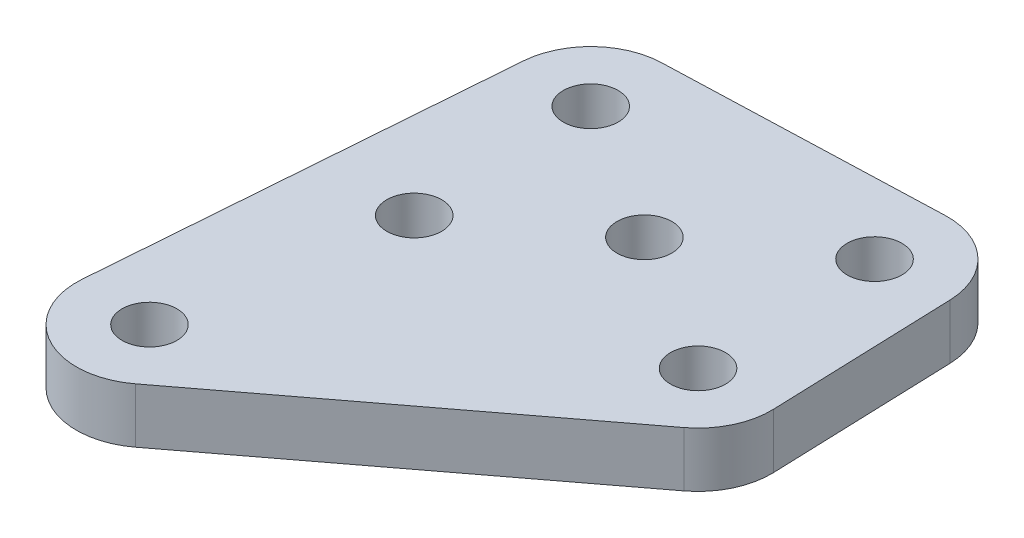
ISO-10303-21;
HEADER;
FILE_DESCRIPTION(('STEP AP214'),'2;1');
FILE_NAME('part.step','',(''),(''),'','','');
FILE_SCHEMA(('AUTOMOTIVE_DESIGN { 1 0 10303 214 1 1 1 1 }'));
ENDSEC;
DATA;
#1=APPLICATION_CONTEXT('core data for automotive mechanical design processes');
#2=APPLICATION_PROTOCOL_DEFINITION('international standard','automotive_design',2000,#1);
#3=PRODUCT_CONTEXT('',#1,'mechanical');
#4=PRODUCT('Part','Part','',(#3));
#5=PRODUCT_RELATED_PRODUCT_CATEGORY('part','',(#4));
#6=PRODUCT_DEFINITION_FORMATION('','',#4);
#7=PRODUCT_DEFINITION_CONTEXT('part definition',#1,'design');
#8=PRODUCT_DEFINITION('design','',#6,#7);
#9=PRODUCT_DEFINITION_SHAPE('','',#8);
#10=(LENGTH_UNIT() NAMED_UNIT(*) SI_UNIT(.MILLI.,.METRE.));
#11=(NAMED_UNIT(*) PLANE_ANGLE_UNIT() SI_UNIT($,.RADIAN.));
#12=(NAMED_UNIT(*) SI_UNIT($,.STERADIAN.) SOLID_ANGLE_UNIT());
#13=UNCERTAINTY_MEASURE_WITH_UNIT(LENGTH_MEASURE(1.E-05),#10,'distance_accuracy_value','');
#14=(GEOMETRIC_REPRESENTATION_CONTEXT(3) GLOBAL_UNCERTAINTY_ASSIGNED_CONTEXT((#13)) GLOBAL_UNIT_ASSIGNED_CONTEXT((#10,
#11,#12)) REPRESENTATION_CONTEXT('',''));
#15=CARTESIAN_POINT('',(0.,0.,0.));
#16=DIRECTION('',(0.,0.,1.));
#17=DIRECTION('',(1.,0.,0.));
#18=AXIS2_PLACEMENT_3D('',#15,#16,#17);
#19=CARTESIAN_POINT('',(-40.696719040631,3.,14.5724052640163));
#20=DIRECTION('',(0.,-1.,0.));
#21=DIRECTION('',(0.,0.,-1.));
#22=AXIS2_PLACEMENT_3D('',#19,#20,#21);
#23=PLANE('',#22);
#24=CARTESIAN_POINT('',(-40.696719040631,3.,14.5724052640163));
#25=DIRECTION('',(0.,1.,0.));
#26=DIRECTION('',(0.,0.,-1.));
#27=AXIS2_PLACEMENT_3D('',#24,#25,#26);
#28=CIRCLE('',#27,4.);
#29=CARTESIAN_POINT('',(-44.6849301355073,3.,14.2655302687726));
#30=VERTEX_POINT('',#29);
#31=CARTESIAN_POINT('',(-38.2818034081284,3.,17.7611640331763));
#32=VERTEX_POINT('',#31);
#33=EDGE_CURVE('E170',#30,#32,#28,.T.);
#34=ORIENTED_EDGE('',*,*,#33,.T.);
#35=DIRECTION('',(0.797189692289983,0.,-0.60372890812566));
#36=VECTOR('',#35,1.);
#37=CARTESIAN_POINT('',(-21.2203623667831,3.,4.84016759962625));
#38=LINE('',#37,#36);
#39=CARTESIAN_POINT('',(-21.2203623667831,3.,4.84016759962625));
#40=VERTEX_POINT('',#39);
#41=EDGE_CURVE('E106',#32,#40,#38,.T.);
#42=ORIENTED_EDGE('',*,*,#41,.T.);
#43=CARTESIAN_POINT('',(-23.6352779992858,3.,1.65140883046631));
#44=DIRECTION('',(0.,1.,0.));
#45=DIRECTION('',(0.,0.,-1.));
#46=AXIS2_PLACEMENT_3D('',#43,#44,#45);
#47=CIRCLE('',#46,4.00000000000001);
#48=CARTESIAN_POINT('',(-19.6376922613152,3.,1.51245463810774));
#49=VERTEX_POINT('',#48);
#50=EDGE_CURVE('E191',#40,#49,#47,.T.);
#51=ORIENTED_EDGE('',*,*,#50,.T.);
#52=DIRECTION('',(-0.0347385480896433,0.,-0.999396434492651));
#53=VECTOR('',#52,1.);
#54=CARTESIAN_POINT('',(-19.9850777422116,3.,-8.48150970681877));
#55=LINE('',#54,#53);
#56=CARTESIAN_POINT('',(-19.9850777422116,3.,-8.48150970681877));
#57=VERTEX_POINT('',#56);
#58=EDGE_CURVE('E205',#49,#57,#55,.T.);
#59=ORIENTED_EDGE('',*,*,#58,.T.);
#60=CARTESIAN_POINT('',(-23.9826634801822,3.,-8.34255551446019));
#61=DIRECTION('',(0.,1.,0.));
#62=DIRECTION('',(0.,0.,-1.));
#63=AXIS2_PLACEMENT_3D('',#60,#61,#62);
#64=CIRCLE('',#63,4.);
#65=CARTESIAN_POINT('',(-24.1216176725408,3.,-12.3401412524308));
#66=VERTEX_POINT('',#65);
#67=EDGE_CURVE('E125',#57,#66,#64,.T.);
#68=ORIENTED_EDGE('',*,*,#67,.T.);
#69=DIRECTION('',(-0.999396434492651,0.,0.0347385480896426));
#70=VECTOR('',#69,1.);
#71=CARTESIAN_POINT('',(-39.1125641899306,3.,-11.8190630310862));
#72=LINE('',#71,#70);
#73=CARTESIAN_POINT('',(-39.1125641899306,3.,-11.8190630310862));
#74=VERTEX_POINT('',#73);
#75=EDGE_CURVE('E119',#66,#74,#72,.T.);
#76=ORIENTED_EDGE('',*,*,#75,.T.);
#77=CARTESIAN_POINT('',(-38.973609997572,3.,-7.82147729311555));
#78=DIRECTION('',(0.,1.,0.));
#79=DIRECTION('',(0.,0.,-1.));
#80=AXIS2_PLACEMENT_3D('',#77,#78,#79);
#81=CIRCLE('',#80,4.00000000000001);
#82=CARTESIAN_POINT('',(-42.9618210924483,3.,-8.12835228835933));
#83=VERTEX_POINT('',#82);
#84=EDGE_CURVE('E123',#74,#83,#81,.T.);
#85=ORIENTED_EDGE('',*,*,#84,.T.);
#86=DIRECTION('',(-0.0767187488109465,0.,0.997052773719066));
#87=VECTOR('',#86,1.);
#88=CARTESIAN_POINT('',(-44.6849301355073,3.,14.2655302687726));
#89=LINE('',#88,#87);
#90=EDGE_CURVE('E63',#83,#30,#89,.T.);
#91=ORIENTED_EDGE('',*,*,#90,.T.);
#92=EDGE_LOOP('',(#34,#42,#51,#59,#68,#76,#85,#91));
#93=FACE_BOUND('',#92,.T.);
#94=CARTESIAN_POINT('',(-23.6352779992858,3.,1.65140883046631));
#95=DIRECTION('',(0.,1.,0.));
#96=DIRECTION('',(0.,0.,-1.));
#97=AXIS2_PLACEMENT_3D('',#94,#95,#96);
#98=CIRCLE('',#97,1.5);
#99=CARTESIAN_POINT('',(-23.6352779992858,3.,0.151408830466318));
#100=VERTEX_POINT('',#99);
#101=EDGE_CURVE('E152',#100,#100,#98,.T.);
#102=ORIENTED_EDGE('',*,*,#101,.F.);
#103=EDGE_LOOP('',(#102));
#104=FACE_BOUND('',#103,.T.);
#105=CARTESIAN_POINT('',(-31.3044439984289,3.,-3.08503423132462));
#106=DIRECTION('',(0.,1.,0.));
#107=DIRECTION('',(0.,0.,-1.));
#108=AXIS2_PLACEMENT_3D('',#105,#106,#107);
#109=CIRCLE('',#108,1.5);
#110=CARTESIAN_POINT('',(-31.3044439984289,3.,-4.58503423132462));
#111=VERTEX_POINT('',#110);
#112=EDGE_CURVE('E219',#111,#111,#109,.T.);
#113=ORIENTED_EDGE('',*,*,#112,.F.);
#114=EDGE_LOOP('',(#113));
#115=FACE_BOUND('',#114,.T.);
#116=CARTESIAN_POINT('',(-23.9826634801822,3.,-8.34255551446019));
#117=DIRECTION('',(0.,1.,0.));
#118=DIRECTION('',(0.,0.,-1.));
#119=AXIS2_PLACEMENT_3D('',#116,#117,#118);
#120=CIRCLE('',#119,1.5);
#121=CARTESIAN_POINT('',(-23.9826634801822,3.,-9.84255551446019));
#122=VERTEX_POINT('',#121);
#123=EDGE_CURVE('E227',#122,#122,#120,.T.);
#124=ORIENTED_EDGE('',*,*,#123,.F.);
#125=EDGE_LOOP('',(#124));
#126=FACE_BOUND('',#125,.T.);
#127=CARTESIAN_POINT('',(-38.973609997572,3.,-7.82147729311555));
#128=DIRECTION('',(0.,1.,0.));
#129=DIRECTION('',(0.,0.,-1.));
#130=AXIS2_PLACEMENT_3D('',#127,#128,#129);
#131=CIRCLE('',#130,1.50000000000001);
#132=CARTESIAN_POINT('',(-38.973609997572,3.,-9.32147729311556));
#133=VERTEX_POINT('',#132);
#134=EDGE_CURVE('E235',#133,#133,#131,.T.);
#135=ORIENTED_EDGE('',*,*,#134,.F.);
#136=EDGE_LOOP('',(#135));
#137=FACE_BOUND('',#136,.T.);
#138=CARTESIAN_POINT('',(-38.6262245166756,3.,2.17248705181095));
#139=DIRECTION('',(0.,1.,0.));
#140=DIRECTION('',(0.,0.,-1.));
#141=AXIS2_PLACEMENT_3D('',#138,#139,#140);
#142=CIRCLE('',#141,1.5);
#143=CARTESIAN_POINT('',(-38.6262245166756,3.,0.672487051810942));
#144=VERTEX_POINT('',#143);
#145=EDGE_CURVE('E243',#144,#144,#142,.T.);
#146=ORIENTED_EDGE('',*,*,#145,.F.);
#147=EDGE_LOOP('',(#146));
#148=FACE_BOUND('',#147,.T.);
#149=CARTESIAN_POINT('',(-40.696719040631,3.,14.5724052640163));
#150=DIRECTION('',(0.,1.,0.));
#151=DIRECTION('',(0.,0.,-1.));
#152=AXIS2_PLACEMENT_3D('',#149,#150,#151);
#153=CIRCLE('',#152,1.49999999999999);
#154=CARTESIAN_POINT('',(-40.696719040631,3.,13.0724052640164));
#155=VERTEX_POINT('',#154);
#156=EDGE_CURVE('E251',#155,#155,#153,.T.);
#157=ORIENTED_EDGE('',*,*,#156,.F.);
#158=EDGE_LOOP('',(#157));
#159=FACE_BOUND('',#158,.T.);
#160=ADVANCED_FACE('F45',(#93,#104,#115,#126,#137,#148,#159),#23,.F.);
#161=CARTESIAN_POINT('',(-40.696719040631,0.,14.5724052640163));
#162=DIRECTION('',(0.,-1.,0.));
#163=DIRECTION('',(0.,0.,-1.));
#164=AXIS2_PLACEMENT_3D('',#161,#162,#163);
#165=PLANE('',#164);
#166=CARTESIAN_POINT('',(-38.6262245166756,0.,2.17248705181095));
#167=DIRECTION('',(0.,1.,0.));
#168=DIRECTION('',(0.,0.,-1.));
#169=AXIS2_PLACEMENT_3D('',#166,#167,#168);
#170=CIRCLE('',#169,1.5);
#171=CARTESIAN_POINT('',(-38.6262245166756,0.,0.672487051810942));
#172=VERTEX_POINT('',#171);
#173=EDGE_CURVE('E247',#172,#172,#170,.T.);
#174=ORIENTED_EDGE('',*,*,#173,.T.);
#175=EDGE_LOOP('',(#174));
#176=FACE_BOUND('',#175,.T.);
#177=CARTESIAN_POINT('',(-23.9826634801822,0.,-8.34255551446019));
#178=DIRECTION('',(0.,1.,0.));
#179=DIRECTION('',(0.,0.,-1.));
#180=AXIS2_PLACEMENT_3D('',#177,#178,#179);
#181=CIRCLE('',#180,1.5);
#182=CARTESIAN_POINT('',(-23.9826634801822,0.,-9.84255551446019));
#183=VERTEX_POINT('',#182);
#184=EDGE_CURVE('E231',#183,#183,#181,.T.);
#185=ORIENTED_EDGE('',*,*,#184,.T.);
#186=EDGE_LOOP('',(#185));
#187=FACE_BOUND('',#186,.T.);
#188=CARTESIAN_POINT('',(-23.6352779992858,0.,1.65140883046631));
#189=DIRECTION('',(0.,1.,0.));
#190=DIRECTION('',(0.,0.,-1.));
#191=AXIS2_PLACEMENT_3D('',#188,#189,#190);
#192=CIRCLE('',#191,1.5);
#193=CARTESIAN_POINT('',(-23.6352779992858,0.,0.151408830466318));
#194=VERTEX_POINT('',#193);
#195=EDGE_CURVE('E215',#194,#194,#192,.T.);
#196=ORIENTED_EDGE('',*,*,#195,.T.);
#197=EDGE_LOOP('',(#196));
#198=FACE_BOUND('',#197,.T.);
#199=CARTESIAN_POINT('',(-40.696719040631,0.,14.5724052640163));
#200=DIRECTION('',(0.,1.,0.));
#201=DIRECTION('',(0.,0.,-1.));
#202=AXIS2_PLACEMENT_3D('',#199,#200,#201);
#203=CIRCLE('',#202,4.);
#204=CARTESIAN_POINT('',(-44.6849301355073,0.,14.2655302687726));
#205=VERTEX_POINT('',#204);
#206=CARTESIAN_POINT('',(-38.2818034081284,0.,17.7611640331763));
#207=VERTEX_POINT('',#206);
#208=EDGE_CURVE('E147',#205,#207,#203,.T.);
#209=ORIENTED_EDGE('',*,*,#208,.F.);
#210=DIRECTION('',(-0.0767187488109465,0.,0.997052773719066));
#211=VECTOR('',#210,1.);
#212=CARTESIAN_POINT('',(-44.6849301355073,0.,14.2655302687726));
#213=LINE('',#212,#211);
#214=CARTESIAN_POINT('',(-42.9618210924483,0.,-8.12835228835933));
#215=VERTEX_POINT('',#214);
#216=EDGE_CURVE('E98',#215,#205,#213,.T.);
#217=ORIENTED_EDGE('',*,*,#216,.F.);
#218=CARTESIAN_POINT('',(-38.973609997572,0.,-7.82147729311555));
#219=DIRECTION('',(0.,1.,0.));
#220=DIRECTION('',(0.,0.,-1.));
#221=AXIS2_PLACEMENT_3D('',#218,#219,#220);
#222=CIRCLE('',#221,4.00000000000001);
#223=CARTESIAN_POINT('',(-39.1125641899306,0.,-11.8190630310862));
#224=VERTEX_POINT('',#223);
#225=EDGE_CURVE('E92',#224,#215,#222,.T.);
#226=ORIENTED_EDGE('',*,*,#225,.F.);
#227=DIRECTION('',(-0.999396434492651,0.,0.0347385480896426));
#228=VECTOR('',#227,1.);
#229=CARTESIAN_POINT('',(-39.1125641899306,0.,-11.8190630310862));
#230=LINE('',#229,#228);
#231=CARTESIAN_POINT('',(-24.1216176725408,0.,-12.3401412524308));
#232=VERTEX_POINT('',#231);
#233=EDGE_CURVE('E134',#232,#224,#230,.T.);
#234=ORIENTED_EDGE('',*,*,#233,.F.);
#235=CARTESIAN_POINT('',(-23.9826634801822,0.,-8.34255551446019));
#236=DIRECTION('',(0.,1.,0.));
#237=DIRECTION('',(0.,0.,-1.));
#238=AXIS2_PLACEMENT_3D('',#235,#236,#237);
#239=CIRCLE('',#238,4.);
#240=CARTESIAN_POINT('',(-19.9850777422116,0.,-8.48150970681877));
#241=VERTEX_POINT('',#240);
#242=EDGE_CURVE('E161',#241,#232,#239,.T.);
#243=ORIENTED_EDGE('',*,*,#242,.F.);
#244=DIRECTION('',(-0.0347385480896433,0.,-0.999396434492651));
#245=VECTOR('',#244,1.);
#246=CARTESIAN_POINT('',(-19.9850777422116,0.,-8.48150970681877));
#247=LINE('',#246,#245);
#248=CARTESIAN_POINT('',(-19.6376922613152,0.,1.51245463810774));
#249=VERTEX_POINT('',#248);
#250=EDGE_CURVE('E158',#249,#241,#247,.T.);
#251=ORIENTED_EDGE('',*,*,#250,.F.);
#252=CARTESIAN_POINT('',(-23.6352779992858,0.,1.65140883046631));
#253=DIRECTION('',(0.,1.,0.));
#254=DIRECTION('',(0.,0.,-1.));
#255=AXIS2_PLACEMENT_3D('',#252,#253,#254);
#256=CIRCLE('',#255,4.00000000000001);
#257=CARTESIAN_POINT('',(-21.2203623667831,0.,4.84016759962625));
#258=VERTEX_POINT('',#257);
#259=EDGE_CURVE('E155',#258,#249,#256,.T.);
#260=ORIENTED_EDGE('',*,*,#259,.F.);
#261=DIRECTION('',(0.797189692289983,0.,-0.60372890812566));
#262=VECTOR('',#261,1.);
#263=CARTESIAN_POINT('',(-21.2203623667831,0.,4.84016759962625));
#264=LINE('',#263,#262);
#265=EDGE_CURVE('E151',#207,#258,#264,.T.);
#266=ORIENTED_EDGE('',*,*,#265,.F.);
#267=EDGE_LOOP('',(#209,#217,#226,#234,#243,#251,#260,#266));
#268=FACE_BOUND('',#267,.T.);
#269=CARTESIAN_POINT('',(-31.3044439984289,0.,-3.08503423132462));
#270=DIRECTION('',(0.,1.,0.));
#271=DIRECTION('',(0.,0.,-1.));
#272=AXIS2_PLACEMENT_3D('',#269,#270,#271);
#273=CIRCLE('',#272,1.5);
#274=CARTESIAN_POINT('',(-31.3044439984289,0.,-4.58503423132462));
#275=VERTEX_POINT('',#274);
#276=EDGE_CURVE('E223',#275,#275,#273,.T.);
#277=ORIENTED_EDGE('',*,*,#276,.T.);
#278=EDGE_LOOP('',(#277));
#279=FACE_BOUND('',#278,.T.);
#280=CARTESIAN_POINT('',(-38.973609997572,0.,-7.82147729311555));
#281=DIRECTION('',(0.,1.,0.));
#282=DIRECTION('',(0.,0.,-1.));
#283=AXIS2_PLACEMENT_3D('',#280,#281,#282);
#284=CIRCLE('',#283,1.50000000000001);
#285=CARTESIAN_POINT('',(-38.973609997572,0.,-9.32147729311556));
#286=VERTEX_POINT('',#285);
#287=EDGE_CURVE('E239',#286,#286,#284,.T.);
#288=ORIENTED_EDGE('',*,*,#287,.T.);
#289=EDGE_LOOP('',(#288));
#290=FACE_BOUND('',#289,.T.);
#291=CARTESIAN_POINT('',(-40.696719040631,0.,14.5724052640163));
#292=DIRECTION('',(0.,1.,0.));
#293=DIRECTION('',(0.,0.,-1.));
#294=AXIS2_PLACEMENT_3D('',#291,#292,#293);
#295=CIRCLE('',#294,1.49999999999999);
#296=CARTESIAN_POINT('',(-40.696719040631,0.,13.0724052640164));
#297=VERTEX_POINT('',#296);
#298=EDGE_CURVE('E255',#297,#297,#295,.T.);
#299=ORIENTED_EDGE('',*,*,#298,.T.);
#300=EDGE_LOOP('',(#299));
#301=FACE_BOUND('',#300,.T.);
#302=ADVANCED_FACE('F195',(#176,#187,#198,#268,#279,#290,#301),#165,.T.);
#303=CARTESIAN_POINT('',(-40.696719040631,3.,14.5724052640163));
#304=DIRECTION('',(0.,-1.,0.));
#305=DIRECTION('',(0.,0.,-1.));
#306=AXIS2_PLACEMENT_3D('',#303,#304,#305);
#307=CYLINDRICAL_SURFACE('',#306,4.);
#308=ORIENTED_EDGE('',*,*,#208,.T.);
#309=DIRECTION('',(0.,-1.,0.));
#310=VECTOR('',#309,1.);
#311=CARTESIAN_POINT('',(-38.2818034081284,3.,17.7611640331763));
#312=LINE('',#311,#310);
#313=EDGE_CURVE('E11',#32,#207,#312,.T.);
#314=ORIENTED_EDGE('',*,*,#313,.F.);
#315=ORIENTED_EDGE('',*,*,#33,.F.);
#316=DIRECTION('',(0.,-1.,0.));
#317=VECTOR('',#316,1.);
#318=CARTESIAN_POINT('',(-44.6849301355073,3.,14.2655302687726));
#319=LINE('',#318,#317);
#320=EDGE_CURVE('E143',#30,#205,#319,.T.);
#321=ORIENTED_EDGE('',*,*,#320,.T.);
#322=EDGE_LOOP('',(#308,#314,#315,#321));
#323=FACE_BOUND('',#322,.T.);
#324=ADVANCED_FACE('F47',(#323),#307,.T.);
#325=CARTESIAN_POINT('',(-21.2203623667831,3.,4.84016759962625));
#326=DIRECTION('',(-0.60372890812566,0.,-0.797189692289983));
#327=DIRECTION('',(-0.797189692289983,0.,0.60372890812566));
#328=AXIS2_PLACEMENT_3D('',#325,#326,#327);
#329=PLANE('',#328);
#330=ORIENTED_EDGE('',*,*,#265,.T.);
#331=DIRECTION('',(0.,-1.,0.));
#332=VECTOR('',#331,1.);
#333=CARTESIAN_POINT('',(-21.2203623667831,3.,4.84016759962625));
#334=LINE('',#333,#332);
#335=EDGE_CURVE('E55',#40,#258,#334,.T.);
#336=ORIENTED_EDGE('',*,*,#335,.F.);
#337=ORIENTED_EDGE('',*,*,#41,.F.);
#338=ORIENTED_EDGE('',*,*,#313,.T.);
#339=EDGE_LOOP('',(#330,#336,#337,#338));
#340=FACE_BOUND('',#339,.T.);
#341=ADVANCED_FACE('F289',(#340),#329,.F.);
#342=CARTESIAN_POINT('',(-23.6352779992858,3.,1.65140883046631));
#343=DIRECTION('',(0.,-1.,0.));
#344=DIRECTION('',(0.,0.,-1.));
#345=AXIS2_PLACEMENT_3D('',#342,#343,#344);
#346=CYLINDRICAL_SURFACE('',#345,4.00000000000001);
#347=ORIENTED_EDGE('',*,*,#259,.T.);
#348=DIRECTION('',(0.,-1.,0.));
#349=VECTOR('',#348,1.);
#350=CARTESIAN_POINT('',(-19.6376922613152,3.,1.51245463810774));
#351=LINE('',#350,#349);
#352=EDGE_CURVE('E181',#49,#249,#351,.T.);
#353=ORIENTED_EDGE('',*,*,#352,.F.);
#354=ORIENTED_EDGE('',*,*,#50,.F.);
#355=ORIENTED_EDGE('',*,*,#335,.T.);
#356=EDGE_LOOP('',(#347,#353,#354,#355));
#357=FACE_BOUND('',#356,.T.);
#358=ADVANCED_FACE('F189',(#357),#346,.T.);
#359=CARTESIAN_POINT('',(-19.9850777422116,3.,-8.48150970681877));
#360=DIRECTION('',(-0.999396434492651,0.,0.0347385480896433));
#361=DIRECTION('',(0.0347385480896433,0.,0.999396434492651));
#362=AXIS2_PLACEMENT_3D('',#359,#360,#361);
#363=PLANE('',#362);
#364=ORIENTED_EDGE('',*,*,#250,.T.);
#365=DIRECTION('',(0.,-1.,0.));
#366=VECTOR('',#365,1.);
#367=CARTESIAN_POINT('',(-19.9850777422116,3.,-8.48150970681877));
#368=LINE('',#367,#366);
#369=EDGE_CURVE('E177',#57,#241,#368,.T.);
#370=ORIENTED_EDGE('',*,*,#369,.F.);
#371=ORIENTED_EDGE('',*,*,#58,.F.);
#372=ORIENTED_EDGE('',*,*,#352,.T.);
#373=EDGE_LOOP('',(#364,#370,#371,#372));
#374=FACE_BOUND('',#373,.T.);
#375=ADVANCED_FACE('F200',(#374),#363,.F.);
#376=CARTESIAN_POINT('',(-23.9826634801822,3.,-8.34255551446019));
#377=DIRECTION('',(0.,-1.,0.));
#378=DIRECTION('',(0.,0.,-1.));
#379=AXIS2_PLACEMENT_3D('',#376,#377,#378);
#380=CYLINDRICAL_SURFACE('',#379,4.);
#381=ORIENTED_EDGE('',*,*,#242,.T.);
#382=DIRECTION('',(0.,-1.,0.));
#383=VECTOR('',#382,1.);
#384=CARTESIAN_POINT('',(-24.1216176725408,3.,-12.3401412524308));
#385=LINE('',#384,#383);
#386=EDGE_CURVE('E136',#66,#232,#385,.T.);
#387=ORIENTED_EDGE('',*,*,#386,.F.);
#388=ORIENTED_EDGE('',*,*,#67,.F.);
#389=ORIENTED_EDGE('',*,*,#369,.T.);
#390=EDGE_LOOP('',(#381,#387,#388,#389));
#391=FACE_BOUND('',#390,.T.);
#392=ADVANCED_FACE('F203',(#391),#380,.T.);
#393=CARTESIAN_POINT('',(-39.1125641899306,3.,-11.8190630310862));
#394=DIRECTION('',(0.0347385480896426,0.,0.999396434492651));
#395=DIRECTION('',(0.999396434492651,0.,-0.0347385480896426));
#396=AXIS2_PLACEMENT_3D('',#393,#394,#395);
#397=PLANE('',#396);
#398=ORIENTED_EDGE('',*,*,#233,.T.);
#399=DIRECTION('',(0.,-1.,0.));
#400=VECTOR('',#399,1.);
#401=CARTESIAN_POINT('',(-39.1125641899306,3.,-11.8190630310862));
#402=LINE('',#401,#400);
#403=EDGE_CURVE('E131',#74,#224,#402,.T.);
#404=ORIENTED_EDGE('',*,*,#403,.F.);
#405=ORIENTED_EDGE('',*,*,#75,.F.);
#406=ORIENTED_EDGE('',*,*,#386,.T.);
#407=EDGE_LOOP('',(#398,#404,#405,#406));
#408=FACE_BOUND('',#407,.T.);
#409=ADVANCED_FACE('F132',(#408),#397,.F.);
#410=CARTESIAN_POINT('',(-38.973609997572,3.,-7.82147729311555));
#411=DIRECTION('',(0.,-1.,0.));
#412=DIRECTION('',(0.,0.,-1.));
#413=AXIS2_PLACEMENT_3D('',#410,#411,#412);
#414=CYLINDRICAL_SURFACE('',#413,4.00000000000001);
#415=ORIENTED_EDGE('',*,*,#225,.T.);
#416=DIRECTION('',(0.,-1.,0.));
#417=VECTOR('',#416,1.);
#418=CARTESIAN_POINT('',(-42.9618210924483,3.,-8.12835228835933));
#419=LINE('',#418,#417);
#420=EDGE_CURVE('E137',#83,#215,#419,.T.);
#421=ORIENTED_EDGE('',*,*,#420,.F.);
#422=ORIENTED_EDGE('',*,*,#84,.F.);
#423=ORIENTED_EDGE('',*,*,#403,.T.);
#424=EDGE_LOOP('',(#415,#421,#422,#423));
#425=FACE_BOUND('',#424,.T.);
#426=ADVANCED_FACE('F139',(#425),#414,.T.);
#427=CARTESIAN_POINT('',(-44.6849301355073,3.,14.2655302687726));
#428=DIRECTION('',(0.997052773719066,0.,0.0767187488109465));
#429=DIRECTION('',(0.0767187488109465,0.,-0.997052773719066));
#430=AXIS2_PLACEMENT_3D('',#427,#428,#429);
#431=PLANE('',#430);
#432=ORIENTED_EDGE('',*,*,#216,.T.);
#433=ORIENTED_EDGE('',*,*,#320,.F.);
#434=ORIENTED_EDGE('',*,*,#90,.F.);
#435=ORIENTED_EDGE('',*,*,#420,.T.);
#436=EDGE_LOOP('',(#432,#433,#434,#435));
#437=FACE_BOUND('',#436,.T.);
#438=ADVANCED_FACE('F277',(#437),#431,.F.);
#439=CARTESIAN_POINT('',(-23.6352779992858,3.,1.65140883046631));
#440=DIRECTION('',(0.,-1.,0.));
#441=DIRECTION('',(0.,0.,-1.));
#442=AXIS2_PLACEMENT_3D('',#439,#440,#441);
#443=CYLINDRICAL_SURFACE('',#442,1.5);
#444=ORIENTED_EDGE('',*,*,#101,.T.);
#445=EDGE_LOOP('',(#444));
#446=FACE_BOUND('',#445,.T.);
#447=ORIENTED_EDGE('',*,*,#195,.F.);
#448=EDGE_LOOP('',(#447));
#449=FACE_BOUND('',#448,.T.);
#450=ADVANCED_FACE('F274',(#446,#449),#443,.F.);
#451=CARTESIAN_POINT('',(-31.3044439984289,3.,-3.08503423132462));
#452=DIRECTION('',(0.,-1.,0.));
#453=DIRECTION('',(0.,0.,-1.));
#454=AXIS2_PLACEMENT_3D('',#451,#452,#453);
#455=CYLINDRICAL_SURFACE('',#454,1.5);
#456=ORIENTED_EDGE('',*,*,#112,.T.);
#457=EDGE_LOOP('',(#456));
#458=FACE_BOUND('',#457,.T.);
#459=ORIENTED_EDGE('',*,*,#276,.F.);
#460=EDGE_LOOP('',(#459));
#461=FACE_BOUND('',#460,.T.);
#462=ADVANCED_FACE('F352',(#458,#461),#455,.F.);
#463=CARTESIAN_POINT('',(-23.9826634801822,3.,-8.34255551446019));
#464=DIRECTION('',(0.,-1.,0.));
#465=DIRECTION('',(0.,0.,-1.));
#466=AXIS2_PLACEMENT_3D('',#463,#464,#465);
#467=CYLINDRICAL_SURFACE('',#466,1.5);
#468=ORIENTED_EDGE('',*,*,#123,.T.);
#469=EDGE_LOOP('',(#468));
#470=FACE_BOUND('',#469,.T.);
#471=ORIENTED_EDGE('',*,*,#184,.F.);
#472=EDGE_LOOP('',(#471));
#473=FACE_BOUND('',#472,.T.);
#474=ADVANCED_FACE('F360',(#470,#473),#467,.F.);
#475=CARTESIAN_POINT('',(-38.973609997572,3.,-7.82147729311555));
#476=DIRECTION('',(0.,-1.,0.));
#477=DIRECTION('',(0.,0.,-1.));
#478=AXIS2_PLACEMENT_3D('',#475,#476,#477);
#479=CYLINDRICAL_SURFACE('',#478,1.50000000000001);
#480=ORIENTED_EDGE('',*,*,#134,.T.);
#481=EDGE_LOOP('',(#480));
#482=FACE_BOUND('',#481,.T.);
#483=ORIENTED_EDGE('',*,*,#287,.F.);
#484=EDGE_LOOP('',(#483));
#485=FACE_BOUND('',#484,.T.);
#486=ADVANCED_FACE('F368',(#482,#485),#479,.F.);
#487=CARTESIAN_POINT('',(-38.6262245166756,3.,2.17248705181095));
#488=DIRECTION('',(0.,-1.,0.));
#489=DIRECTION('',(0.,0.,-1.));
#490=AXIS2_PLACEMENT_3D('',#487,#488,#489);
#491=CYLINDRICAL_SURFACE('',#490,1.5);
#492=ORIENTED_EDGE('',*,*,#145,.T.);
#493=EDGE_LOOP('',(#492));
#494=FACE_BOUND('',#493,.T.);
#495=ORIENTED_EDGE('',*,*,#173,.F.);
#496=EDGE_LOOP('',(#495));
#497=FACE_BOUND('',#496,.T.);
#498=ADVANCED_FACE('F377',(#494,#497),#491,.F.);
#499=CARTESIAN_POINT('',(-40.696719040631,3.,14.5724052640163));
#500=DIRECTION('',(0.,-1.,0.));
#501=DIRECTION('',(0.,0.,-1.));
#502=AXIS2_PLACEMENT_3D('',#499,#500,#501);
#503=CYLINDRICAL_SURFACE('',#502,1.49999999999999);
#504=ORIENTED_EDGE('',*,*,#156,.T.);
#505=EDGE_LOOP('',(#504));
#506=FACE_BOUND('',#505,.T.);
#507=ORIENTED_EDGE('',*,*,#298,.F.);
#508=EDGE_LOOP('',(#507));
#509=FACE_BOUND('',#508,.T.);
#510=ADVANCED_FACE('F263',(#506,#509),#503,.F.);
#511=CLOSED_SHELL('',(#160,#302,#324,#341,#358,#375,#392,#409,#426,#438,#450,#462,#474,#486,
#498,#510));
#512=MANIFOLD_SOLID_BREP('B2',#511);
#513=ADVANCED_BREP_SHAPE_REPRESENTATION('',(#18,#512),#14);
#514=SHAPE_DEFINITION_REPRESENTATION(#9,#513);
ENDSEC;
END-ISO-10303-21;
